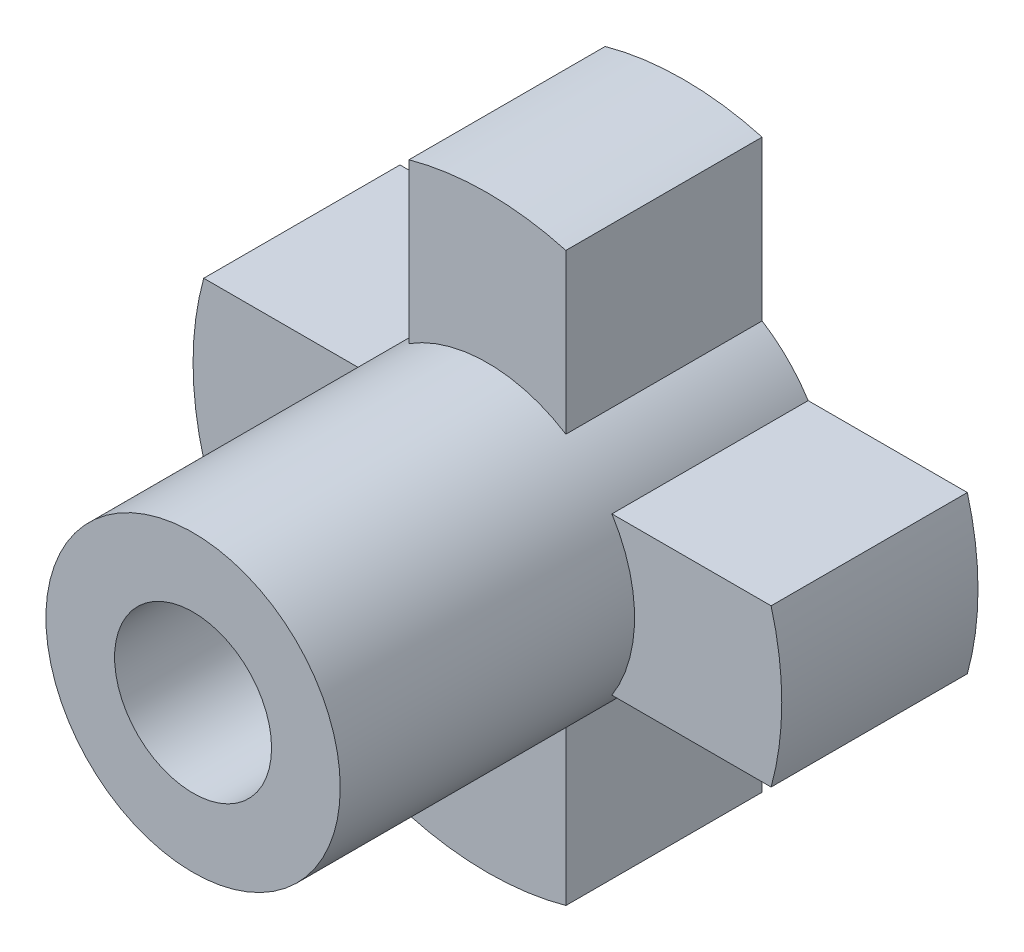
ISO-10303-21;
HEADER;
FILE_DESCRIPTION(('STEP AP214'),'2;1');
FILE_NAME('part.step','',(''),(''),'','','');
FILE_SCHEMA(('AUTOMOTIVE_DESIGN { 1 0 10303 214 1 1 1 1 }'));
ENDSEC;
DATA;
#1=APPLICATION_CONTEXT('core data for automotive mechanical design processes');
#2=APPLICATION_PROTOCOL_DEFINITION('international standard','automotive_design',2000,#1);
#3=PRODUCT_CONTEXT('',#1,'mechanical');
#4=PRODUCT('Part','Part','',(#3));
#5=PRODUCT_RELATED_PRODUCT_CATEGORY('part','',(#4));
#6=PRODUCT_DEFINITION_FORMATION('','',#4);
#7=PRODUCT_DEFINITION_CONTEXT('part definition',#1,'design');
#8=PRODUCT_DEFINITION('design','',#6,#7);
#9=PRODUCT_DEFINITION_SHAPE('','',#8);
#10=(LENGTH_UNIT() NAMED_UNIT(*) SI_UNIT(.MILLI.,.METRE.));
#11=(NAMED_UNIT(*) PLANE_ANGLE_UNIT() SI_UNIT($,.RADIAN.));
#12=(NAMED_UNIT(*) SI_UNIT($,.STERADIAN.) SOLID_ANGLE_UNIT());
#13=UNCERTAINTY_MEASURE_WITH_UNIT(LENGTH_MEASURE(1.E-05),#10,'distance_accuracy_value','');
#14=(GEOMETRIC_REPRESENTATION_CONTEXT(3) GLOBAL_UNCERTAINTY_ASSIGNED_CONTEXT((#13)) GLOBAL_UNIT_ASSIGNED_CONTEXT((#10,
#11,#12)) REPRESENTATION_CONTEXT('',''));
#15=CARTESIAN_POINT('',(0.,0.,0.));
#16=DIRECTION('',(0.,0.,1.));
#17=DIRECTION('',(1.,0.,0.));
#18=AXIS2_PLACEMENT_3D('',#15,#16,#17);
#19=CARTESIAN_POINT('',(0.,0.,10.));
#20=DIRECTION('',(0.,0.,-1.));
#21=DIRECTION('',(-1.,0.,0.));
#22=AXIS2_PLACEMENT_3D('',#19,#20,#21);
#23=CYLINDRICAL_SURFACE('',#22,15.);
#24=CARTESIAN_POINT('',(0.,0.,10.));
#25=DIRECTION('',(0.,0.,1.));
#26=DIRECTION('',(1.,0.,0.));
#27=AXIS2_PLACEMENT_3D('',#24,#25,#26);
#28=CIRCLE('',#27,15.);
#29=CARTESIAN_POINT('',(-4.,-14.456832294801,10.));
#30=VERTEX_POINT('',#29);
#31=CARTESIAN_POINT('',(4.,-14.456832294801,10.));
#32=VERTEX_POINT('',#31);
#33=EDGE_CURVE('E269',#30,#32,#28,.T.);
#34=ORIENTED_EDGE('',*,*,#33,.F.);
#35=DIRECTION('',(0.,0.,-1.));
#36=VECTOR('',#35,1.);
#37=CARTESIAN_POINT('',(-4.,-14.456832294801,20.));
#38=LINE('',#37,#36);
#39=CARTESIAN_POINT('',(-4.,-14.456832294801,0.));
#40=VERTEX_POINT('',#39);
#41=EDGE_CURVE('E196',#30,#40,#38,.T.);
#42=ORIENTED_EDGE('',*,*,#41,.T.);
#43=CARTESIAN_POINT('',(0.,0.,0.));
#44=DIRECTION('',(0.,0.,1.));
#45=DIRECTION('',(1.,0.,0.));
#46=AXIS2_PLACEMENT_3D('',#43,#44,#45);
#47=CIRCLE('',#46,15.);
#48=CARTESIAN_POINT('',(4.,-14.456832294801,0.));
#49=VERTEX_POINT('',#48);
#50=EDGE_CURVE('E271',#40,#49,#47,.T.);
#51=ORIENTED_EDGE('',*,*,#50,.T.);
#52=DIRECTION('',(0.,0.,-1.));
#53=VECTOR('',#52,1.);
#54=CARTESIAN_POINT('',(4.,-14.456832294801,20.));
#55=LINE('',#54,#53);
#56=EDGE_CURVE('E234',#32,#49,#55,.T.);
#57=ORIENTED_EDGE('',*,*,#56,.F.);
#58=EDGE_LOOP('',(#34,#42,#51,#57));
#59=FACE_BOUND('',#58,.T.);
#60=ADVANCED_FACE('F33',(#59),#23,.T.);
#61=CARTESIAN_POINT('',(-14.456832294801,4.,0.));
#62=VERTEX_POINT('',#61);
#63=CARTESIAN_POINT('',(-14.456832294801,-4.,0.));
#64=VERTEX_POINT('',#63);
#65=EDGE_CURVE('E274',#62,#64,#47,.T.);
#66=ORIENTED_EDGE('',*,*,#65,.T.);
#67=DIRECTION('',(0.,0.,-1.));
#68=VECTOR('',#67,1.);
#69=CARTESIAN_POINT('',(-14.456832294801,-4.,20.));
#70=LINE('',#69,#68);
#71=CARTESIAN_POINT('',(-14.456832294801,-4.,10.));
#72=VERTEX_POINT('',#71);
#73=EDGE_CURVE('E64',#72,#64,#70,.T.);
#74=ORIENTED_EDGE('',*,*,#73,.F.);
#75=CARTESIAN_POINT('',(-14.456832294801,4.,10.));
#76=VERTEX_POINT('',#75);
#77=EDGE_CURVE('E294',#76,#72,#28,.T.);
#78=ORIENTED_EDGE('',*,*,#77,.F.);
#79=DIRECTION('',(0.,0.,-1.));
#80=VECTOR('',#79,1.);
#81=CARTESIAN_POINT('',(-14.456832294801,4.,20.));
#82=LINE('',#81,#80);
#83=EDGE_CURVE('E177',#76,#62,#82,.T.);
#84=ORIENTED_EDGE('',*,*,#83,.T.);
#85=EDGE_LOOP('',(#66,#74,#78,#84));
#86=FACE_BOUND('',#85,.T.);
#87=ADVANCED_FACE('F281',(#86),#23,.T.);
#88=CARTESIAN_POINT('',(4.,14.456832294801,0.));
#89=VERTEX_POINT('',#88);
#90=CARTESIAN_POINT('',(-4.,14.456832294801,0.));
#91=VERTEX_POINT('',#90);
#92=EDGE_CURVE('E270',#89,#91,#47,.T.);
#93=ORIENTED_EDGE('',*,*,#92,.T.);
#94=DIRECTION('',(0.,0.,-1.));
#95=VECTOR('',#94,1.);
#96=CARTESIAN_POINT('',(-4.,14.456832294801,20.));
#97=LINE('',#96,#95);
#98=CARTESIAN_POINT('',(-4.,14.456832294801,10.));
#99=VERTEX_POINT('',#98);
#100=EDGE_CURVE('E201',#99,#91,#97,.T.);
#101=ORIENTED_EDGE('',*,*,#100,.F.);
#102=CARTESIAN_POINT('',(4.,14.456832294801,10.));
#103=VERTEX_POINT('',#102);
#104=EDGE_CURVE('E266',#103,#99,#28,.T.);
#105=ORIENTED_EDGE('',*,*,#104,.F.);
#106=DIRECTION('',(0.,0.,-1.));
#107=VECTOR('',#106,1.);
#108=CARTESIAN_POINT('',(4.,14.456832294801,20.));
#109=LINE('',#108,#107);
#110=EDGE_CURVE('E187',#103,#89,#109,.T.);
#111=ORIENTED_EDGE('',*,*,#110,.T.);
#112=EDGE_LOOP('',(#93,#101,#105,#111));
#113=FACE_BOUND('',#112,.T.);
#114=ADVANCED_FACE('F324',(#113),#23,.T.);
#115=CARTESIAN_POINT('',(0.,0.,10.));
#116=DIRECTION('',(0.,0.,1.));
#117=DIRECTION('',(1.,0.,0.));
#118=AXIS2_PLACEMENT_3D('',#115,#116,#117);
#119=PLANE('',#118);
#120=DIRECTION('',(0.,1.,0.));
#121=VECTOR('',#120,1.);
#122=CARTESIAN_POINT('',(-3.99999999999999,0.,10.));
#123=LINE('',#122,#121);
#124=CARTESIAN_POINT('',(-4.,-6.34428877022476,10.));
#125=VERTEX_POINT('',#124);
#126=EDGE_CURVE('E253',#30,#125,#123,.T.);
#127=ORIENTED_EDGE('',*,*,#126,.F.);
#128=ORIENTED_EDGE('',*,*,#33,.T.);
#129=DIRECTION('',(0.,-1.,0.));
#130=VECTOR('',#129,1.);
#131=CARTESIAN_POINT('',(4.,0.,10.));
#132=LINE('',#131,#130);
#133=CARTESIAN_POINT('',(4.,-6.34428877022476,10.));
#134=VERTEX_POINT('',#133);
#135=EDGE_CURVE('E241',#134,#32,#132,.T.);
#136=ORIENTED_EDGE('',*,*,#135,.F.);
#137=CARTESIAN_POINT('',(0.,0.,10.));
#138=DIRECTION('',(0.,0.,1.));
#139=DIRECTION('',(1.,0.,0.));
#140=AXIS2_PLACEMENT_3D('',#137,#138,#139);
#141=CIRCLE('',#140,7.5);
#142=EDGE_CURVE('E265',#125,#134,#141,.T.);
#143=ORIENTED_EDGE('',*,*,#142,.F.);
#144=EDGE_LOOP('',(#127,#128,#136,#143));
#145=FACE_BOUND('',#144,.T.);
#146=ADVANCED_FACE('F302',(#145),#119,.T.);
#147=DIRECTION('',(-1.,0.,0.));
#148=VECTOR('',#147,1.);
#149=CARTESIAN_POINT('',(0.,-4.,10.));
#150=LINE('',#149,#148);
#151=CARTESIAN_POINT('',(-6.34428877022476,-4.,10.));
#152=VERTEX_POINT('',#151);
#153=EDGE_CURVE('E251',#152,#72,#150,.T.);
#154=ORIENTED_EDGE('',*,*,#153,.F.);
#155=CARTESIAN_POINT('',(-6.34428877022476,4.,10.));
#156=VERTEX_POINT('',#155);
#157=EDGE_CURVE('E47',#156,#152,#141,.T.);
#158=ORIENTED_EDGE('',*,*,#157,.F.);
#159=DIRECTION('',(1.,0.,0.));
#160=VECTOR('',#159,1.);
#161=CARTESIAN_POINT('',(0.,4.,10.));
#162=LINE('',#161,#160);
#163=EDGE_CURVE('E249',#76,#156,#162,.T.);
#164=ORIENTED_EDGE('',*,*,#163,.F.);
#165=ORIENTED_EDGE('',*,*,#77,.T.);
#166=EDGE_LOOP('',(#154,#158,#164,#165));
#167=FACE_BOUND('',#166,.T.);
#168=ADVANCED_FACE('F292',(#167),#119,.T.);
#169=DIRECTION('',(0.,1.,0.));
#170=VECTOR('',#169,1.);
#171=CARTESIAN_POINT('',(-4.,0.,10.));
#172=LINE('',#171,#170);
#173=CARTESIAN_POINT('',(-4.,6.34428877022476,10.));
#174=VERTEX_POINT('',#173);
#175=EDGE_CURVE('E247',#174,#99,#172,.T.);
#176=ORIENTED_EDGE('',*,*,#175,.F.);
#177=CARTESIAN_POINT('',(4.,6.34428877022476,10.));
#178=VERTEX_POINT('',#177);
#179=EDGE_CURVE('E11',#178,#174,#141,.T.);
#180=ORIENTED_EDGE('',*,*,#179,.F.);
#181=DIRECTION('',(0.,-1.,0.));
#182=VECTOR('',#181,1.);
#183=CARTESIAN_POINT('',(4.,0.,10.));
#184=LINE('',#183,#182);
#185=EDGE_CURVE('E245',#103,#178,#184,.T.);
#186=ORIENTED_EDGE('',*,*,#185,.F.);
#187=ORIENTED_EDGE('',*,*,#104,.T.);
#188=EDGE_LOOP('',(#176,#180,#186,#187));
#189=FACE_BOUND('',#188,.T.);
#190=ADVANCED_FACE('F319',(#189),#119,.T.);
#191=CARTESIAN_POINT('',(14.456832294801,-4.,0.));
#192=VERTEX_POINT('',#191);
#193=CARTESIAN_POINT('',(14.456832294801,4.,0.));
#194=VERTEX_POINT('',#193);
#195=EDGE_CURVE('E263',#192,#194,#47,.T.);
#196=ORIENTED_EDGE('',*,*,#195,.T.);
#197=DIRECTION('',(0.,0.,-1.));
#198=VECTOR('',#197,1.);
#199=CARTESIAN_POINT('',(14.456832294801,4.,20.));
#200=LINE('',#199,#198);
#201=CARTESIAN_POINT('',(14.456832294801,4.,10.));
#202=VERTEX_POINT('',#201);
#203=EDGE_CURVE('E168',#202,#194,#200,.T.);
#204=ORIENTED_EDGE('',*,*,#203,.F.);
#205=CARTESIAN_POINT('',(14.456832294801,-4.,10.));
#206=VERTEX_POINT('',#205);
#207=EDGE_CURVE('E267',#206,#202,#28,.T.);
#208=ORIENTED_EDGE('',*,*,#207,.F.);
#209=DIRECTION('',(0.,0.,-1.));
#210=VECTOR('',#209,1.);
#211=CARTESIAN_POINT('',(14.456832294801,-4.,20.));
#212=LINE('',#211,#210);
#213=EDGE_CURVE('E236',#206,#192,#212,.T.);
#214=ORIENTED_EDGE('',*,*,#213,.T.);
#215=EDGE_LOOP('',(#196,#204,#208,#214));
#216=FACE_BOUND('',#215,.T.);
#217=ADVANCED_FACE('F35',(#216),#23,.T.);
#218=DIRECTION('',(1.,0.,0.));
#219=VECTOR('',#218,1.);
#220=CARTESIAN_POINT('',(0.,4.,10.));
#221=LINE('',#220,#219);
#222=CARTESIAN_POINT('',(6.34428877022476,4.,10.));
#223=VERTEX_POINT('',#222);
#224=EDGE_CURVE('E243',#223,#202,#221,.T.);
#225=ORIENTED_EDGE('',*,*,#224,.F.);
#226=CARTESIAN_POINT('',(6.34428877022476,-4.,10.));
#227=VERTEX_POINT('',#226);
#228=EDGE_CURVE('E49',#227,#223,#141,.T.);
#229=ORIENTED_EDGE('',*,*,#228,.F.);
#230=DIRECTION('',(-1.,0.,0.));
#231=VECTOR('',#230,1.);
#232=CARTESIAN_POINT('',(0.,-4.,10.));
#233=LINE('',#232,#231);
#234=EDGE_CURVE('E233',#206,#227,#233,.T.);
#235=ORIENTED_EDGE('',*,*,#234,.F.);
#236=ORIENTED_EDGE('',*,*,#207,.T.);
#237=EDGE_LOOP('',(#225,#229,#235,#236));
#238=FACE_BOUND('',#237,.T.);
#239=ADVANCED_FACE('F316',(#238),#119,.T.);
#240=CARTESIAN_POINT('',(0.,0.,0.));
#241=DIRECTION('',(0.,0.,1.));
#242=DIRECTION('',(1.,0.,0.));
#243=AXIS2_PLACEMENT_3D('',#240,#241,#242);
#244=PLANE('',#243);
#245=ORIENTED_EDGE('',*,*,#50,.F.);
#246=DIRECTION('',(0.,-1.,0.));
#247=VECTOR('',#246,1.);
#248=CARTESIAN_POINT('',(-4.,-14.456832294801,0.));
#249=LINE('',#248,#247);
#250=CARTESIAN_POINT('',(-4.,-6.34428877022476,0.));
#251=VERTEX_POINT('',#250);
#252=EDGE_CURVE('E215',#251,#40,#249,.T.);
#253=ORIENTED_EDGE('',*,*,#252,.F.);
#254=CARTESIAN_POINT('',(0.,0.,0.));
#255=DIRECTION('',(0.,0.,1.));
#256=DIRECTION('',(-1.,0.,0.));
#257=AXIS2_PLACEMENT_3D('',#254,#255,#256);
#258=CIRCLE('',#257,7.5);
#259=CARTESIAN_POINT('',(-6.34428877022476,-4.,0.));
#260=VERTEX_POINT('',#259);
#261=EDGE_CURVE('E211',#260,#251,#258,.T.);
#262=ORIENTED_EDGE('',*,*,#261,.F.);
#263=DIRECTION('',(1.,0.,0.));
#264=VECTOR('',#263,1.);
#265=CARTESIAN_POINT('',(-14.456832294801,-4.,0.));
#266=LINE('',#265,#264);
#267=EDGE_CURVE('E209',#64,#260,#266,.T.);
#268=ORIENTED_EDGE('',*,*,#267,.F.);
#269=ORIENTED_EDGE('',*,*,#65,.F.);
#270=DIRECTION('',(-1.,0.,0.));
#271=VECTOR('',#270,1.);
#272=CARTESIAN_POINT('',(-14.456832294801,4.,0.));
#273=LINE('',#272,#271);
#274=CARTESIAN_POINT('',(-6.34428877022476,4.,0.));
#275=VERTEX_POINT('',#274);
#276=EDGE_CURVE('E199',#275,#62,#273,.T.);
#277=ORIENTED_EDGE('',*,*,#276,.F.);
#278=CARTESIAN_POINT('',(0.,0.,0.));
#279=DIRECTION('',(0.,0.,1.));
#280=DIRECTION('',(-1.,0.,0.));
#281=AXIS2_PLACEMENT_3D('',#278,#279,#280);
#282=CIRCLE('',#281,7.5);
#283=CARTESIAN_POINT('',(-4.,6.34428877022476,0.));
#284=VERTEX_POINT('',#283);
#285=EDGE_CURVE('E195',#284,#275,#282,.T.);
#286=ORIENTED_EDGE('',*,*,#285,.F.);
#287=DIRECTION('',(0.,-1.,0.));
#288=VECTOR('',#287,1.);
#289=CARTESIAN_POINT('',(-4.,6.34428877022476,0.));
#290=LINE('',#289,#288);
#291=EDGE_CURVE('E192',#91,#284,#290,.T.);
#292=ORIENTED_EDGE('',*,*,#291,.F.);
#293=ORIENTED_EDGE('',*,*,#92,.F.);
#294=DIRECTION('',(0.,1.,0.));
#295=VECTOR('',#294,1.);
#296=CARTESIAN_POINT('',(4.,6.34428877022476,0.));
#297=LINE('',#296,#295);
#298=CARTESIAN_POINT('',(4.,6.34428877022476,0.));
#299=VERTEX_POINT('',#298);
#300=EDGE_CURVE('E182',#299,#89,#297,.T.);
#301=ORIENTED_EDGE('',*,*,#300,.F.);
#302=CARTESIAN_POINT('',(0.,0.,0.));
#303=DIRECTION('',(0.,0.,1.));
#304=DIRECTION('',(-1.,0.,0.));
#305=AXIS2_PLACEMENT_3D('',#302,#303,#304);
#306=CIRCLE('',#305,7.5);
#307=CARTESIAN_POINT('',(6.34428877022476,4.,0.));
#308=VERTEX_POINT('',#307);
#309=EDGE_CURVE('E162',#308,#299,#306,.T.);
#310=ORIENTED_EDGE('',*,*,#309,.F.);
#311=DIRECTION('',(-1.,0.,0.));
#312=VECTOR('',#311,1.);
#313=CARTESIAN_POINT('',(6.34428877022476,4.,0.));
#314=LINE('',#313,#312);
#315=EDGE_CURVE('E171',#194,#308,#314,.T.);
#316=ORIENTED_EDGE('',*,*,#315,.F.);
#317=ORIENTED_EDGE('',*,*,#195,.F.);
#318=DIRECTION('',(1.,0.,0.));
#319=VECTOR('',#318,1.);
#320=CARTESIAN_POINT('',(6.34428877022476,-4.,0.));
#321=LINE('',#320,#319);
#322=CARTESIAN_POINT('',(6.34428877022476,-4.,0.));
#323=VERTEX_POINT('',#322);
#324=EDGE_CURVE('E225',#323,#192,#321,.T.);
#325=ORIENTED_EDGE('',*,*,#324,.F.);
#326=CARTESIAN_POINT('',(0.,0.,0.));
#327=DIRECTION('',(0.,0.,1.));
#328=DIRECTION('',(-1.,0.,0.));
#329=AXIS2_PLACEMENT_3D('',#326,#327,#328);
#330=CIRCLE('',#329,7.5);
#331=CARTESIAN_POINT('',(4.,-6.34428877022476,0.));
#332=VERTEX_POINT('',#331);
#333=EDGE_CURVE('E56',#332,#323,#330,.T.);
#334=ORIENTED_EDGE('',*,*,#333,.F.);
#335=DIRECTION('',(0.,1.,0.));
#336=VECTOR('',#335,1.);
#337=CARTESIAN_POINT('',(4.,-14.456832294801,0.));
#338=LINE('',#337,#336);
#339=EDGE_CURVE('E227',#49,#332,#338,.T.);
#340=ORIENTED_EDGE('',*,*,#339,.F.);
#341=EDGE_LOOP('',(#245,#253,#262,#268,#269,#277,#286,#292,#293,#301,#310,#316,#317,#325,#334,#340));
#342=FACE_BOUND('',#341,.T.);
#343=ADVANCED_FACE('F180',(#342),#244,.F.);
#344=CARTESIAN_POINT('',(0.,0.,25.));
#345=DIRECTION('',(0.,0.,-1.));
#346=DIRECTION('',(-1.,0.,0.));
#347=AXIS2_PLACEMENT_3D('',#344,#345,#346);
#348=CYLINDRICAL_SURFACE('',#347,7.5);
#349=CARTESIAN_POINT('',(-7.5,0.,14.5040404307137));
#350=CARTESIAN_POINT('',(-7.49999846371307,-0.0833653601889498,14.5040373639661));
#351=CARTESIAN_POINT('',(-7.49859577767346,-0.166769490302284,14.4970671662622));
#352=CARTESIAN_POINT('',(-7.49313548434847,-0.331220261533529,14.4693926805408));
#353=CARTESIAN_POINT('',(-7.48907576790279,-0.412264976312034,14.4486774815114));
#354=CARTESIAN_POINT('',(-7.4787547391743,-0.56959545789497,14.3941785202825));
#355=CARTESIAN_POINT('',(-7.47249553615077,-0.645885701899702,14.3604072754466));
#356=CARTESIAN_POINT('',(-7.45845597052971,-0.791711983296339,14.2807920594467));
#357=CARTESIAN_POINT('',(-7.4506756985356,-0.861248422613718,14.2349488073029));
#358=CARTESIAN_POINT('',(-7.43433247994955,-0.992540215972298,14.1318326892765));
#359=CARTESIAN_POINT('',(-7.42576118256521,-1.05419092673779,14.0744278976269));
#360=CARTESIAN_POINT('',(-7.40886270678882,-1.16705513491204,13.9501018061261));
#361=CARTESIAN_POINT('',(-7.40053554750636,-1.21826781715564,13.883179763711));
#362=CARTESIAN_POINT('',(-7.38498662718923,-1.30924763002143,13.7409661411958));
#363=CARTESIAN_POINT('',(-7.37777561047419,-1.3489064082988,13.6656039650191));
#364=CARTESIAN_POINT('',(-7.36539402087627,-1.41495849987046,13.5091177022075));
#365=CARTESIAN_POINT('',(-7.36022324642942,-1.44135312365586,13.4279941856941));
#366=CARTESIAN_POINT('',(-7.35259207878307,-1.47978794982724,13.2634138848518));
#367=CARTESIAN_POINT('',(-7.35009705160781,-1.49201174693817,13.1800016145003));
#368=CARTESIAN_POINT('',(-7.34799562590941,-1.50232819158918,13.0122756986671));
#369=CARTESIAN_POINT('',(-7.34838893201761,-1.50042228407025,12.9279621462334));
#370=CARTESIAN_POINT('',(-7.35198826722277,-1.48268185965273,12.7621702486822));
#371=CARTESIAN_POINT('',(-7.35515179288145,-1.46705781036586,12.6806683222727));
#372=CARTESIAN_POINT('',(-7.36386819240002,-1.42265682693458,12.5214663157192));
#373=CARTESIAN_POINT('',(-7.36942118036668,-1.39387926465102,12.4437664173351));
#374=CARTESIAN_POINT('',(-7.38233427750612,-1.32378717551208,12.2937675381583));
#375=CARTESIAN_POINT('',(-7.38970634720557,-1.28238922684817,12.2215086113599));
#376=CARTESIAN_POINT('',(-7.40541928159593,-1.18829036185902,12.0848841557544));
#377=CARTESIAN_POINT('',(-7.41376025757549,-1.13558814653524,12.0205195354369));
#378=CARTESIAN_POINT('',(-7.43065531862193,-1.01924990184088,11.9002963270283));
#379=CARTESIAN_POINT('',(-7.43921053816357,-0.955434241818667,11.844611578925));
#380=CARTESIAN_POINT('',(-7.45543273071613,-0.819277536093015,11.7447096612618));
#381=CARTESIAN_POINT('',(-7.4630996923346,-0.746936381069084,11.7004926387733));
#382=CARTESIAN_POINT('',(-7.47670035241331,-0.595589080318381,11.6247491668747));
#383=CARTESIAN_POINT('',(-7.48263133272408,-0.51657272937795,11.5932425902469));
#384=CARTESIAN_POINT('',(-7.49207113481787,-0.354223464672997,11.5439997196558));
#385=CARTESIAN_POINT('',(-7.49558025000797,-0.270891075108674,11.5262617576032));
#386=CARTESIAN_POINT('',(-7.49974007800302,-0.103769108440725,11.5053057500222));
#387=CARTESIAN_POINT('',(-7.50043761978705,-0.020010492488364,11.5018498014033));
#388=CARTESIAN_POINT('',(-7.49902577895154,0.146887401289071,11.5089152191269));
#389=CARTESIAN_POINT('',(-7.49691655412169,0.23002671366569,11.5194357997426));
#390=CARTESIAN_POINT('',(-7.49015748012026,0.392558489919812,11.5539579910296));
#391=CARTESIAN_POINT('',(-7.4855306460631,0.471977922509856,11.5778375334605));
#392=CARTESIAN_POINT('',(-7.47425328091549,0.625685441249502,11.6382664046974));
#393=CARTESIAN_POINT('',(-7.4676025982134,0.69997314245631,11.6748166827289));
#394=CARTESIAN_POINT('',(-7.45289867299942,0.842311760529327,11.7600641666906));
#395=CARTESIAN_POINT('',(-7.44482925655578,0.910275190128282,11.8089046022721));
#396=CARTESIAN_POINT('',(-7.42822102244824,1.03712702867881,11.9171542175246));
#397=CARTESIAN_POINT('',(-7.41968215452582,1.09601446339614,11.9765645303135));
#398=CARTESIAN_POINT('',(-7.40293955335447,1.20396088616126,12.1053504585503));
#399=CARTESIAN_POINT('',(-7.39474290349956,1.25285655367298,12.1748640470457));
#400=CARTESIAN_POINT('',(-7.37976287694291,1.33827813007681,12.3212574727487));
#401=CARTESIAN_POINT('',(-7.37297944370014,1.37480453388435,12.398137015074));
#402=CARTESIAN_POINT('',(-7.36165110876574,1.43422776237294,12.556692799938));
#403=CARTESIAN_POINT('',(-7.3570946230828,1.45719524968658,12.6383416925291));
#404=CARTESIAN_POINT('',(-7.35071155188038,1.48906297744079,12.80444061095));
#405=CARTESIAN_POINT('',(-7.34888461036667,1.49796505233767,12.8888902700277));
#406=CARTESIAN_POINT('',(-7.34818724447069,1.5013813663012,13.0565537275301));
#407=CARTESIAN_POINT('',(-7.34926378783951,1.49615368210634,13.1397621541042));
#408=CARTESIAN_POINT('',(-7.35413360226921,1.47202845615009,13.3040879055712));
#409=CARTESIAN_POINT('',(-7.35792685150754,1.45313102419395,13.3852052472559));
#410=CARTESIAN_POINT('',(-7.36777896328738,1.40231785274843,13.5428819975745));
#411=CARTESIAN_POINT('',(-7.37383231528246,1.37043376007602,13.6194519714673));
#412=CARTESIAN_POINT('',(-7.38752572461255,1.29458196690241,13.7661960118153));
#413=CARTESIAN_POINT('',(-7.39516591498341,1.25061325316232,13.8363695413014));
#414=CARTESIAN_POINT('',(-7.41133440784838,1.15095887217962,13.9696137889391));
#415=CARTESIAN_POINT('',(-7.41987559364549,1.09508683085277,14.0325435786151));
#416=CARTESIAN_POINT('',(-7.43679122807932,0.97359655351971,14.1482197390074));
#417=CARTESIAN_POINT('',(-7.44516563794777,0.907976080730002,14.2009637661896));
#418=CARTESIAN_POINT('',(-7.46090748581957,0.76802644363237,14.2952923966333));
#419=CARTESIAN_POINT('',(-7.46826346828869,0.693613326644753,14.3367544356337));
#420=CARTESIAN_POINT('',(-7.481026876275,0.5387495414111,14.4065196146085));
#421=CARTESIAN_POINT('',(-7.48643605707924,0.45830439129469,14.4348346150124));
#422=CARTESIAN_POINT('',(-7.49364558893056,0.314732233385669,14.4720183527807));
#423=CARTESIAN_POINT('',(-7.49601454737677,0.252422496020677,14.4840052212753));
#424=CARTESIAN_POINT('',(-7.49919231209839,0.1267492878151,14.5000172992512));
#425=CARTESIAN_POINT('',(-7.50000116809732,0.0633858506229285,14.5040427624783));
#426=CARTESIAN_POINT('',(-7.5,0.,14.5040404307137));
#427=B_SPLINE_CURVE_WITH_KNOTS('',3,(#349,#350,#351,#352,#353,#354,#355,#356,#357,#358,#359,
#360,#361,#362,#363,#364,#365,#366,#367,#368,#369,#370,#371,#372,#373,#374,#375,#376,#377,#378,
#379,#380,#381,#382,#383,#384,#385,#386,#387,#388,#389,#390,#391,#392,#393,#394,#395,#396,#397,
#398,#399,#400,#401,#402,#403,#404,#405,#406,#407,#408,#409,#410,#411,#412,#413,#414,#415,#416,
#417,#418,#419,#420,#421,#422,#423,#424,#425,#426),.UNSPECIFIED.,.T.,.F.,(4,2,2,2,2,2,2,2,2,2,2,
2,2,2,2,2,2,2,2,2,2,2,2,2,2,2,2,2,2,2,2,2,2,2,2,2,2,2,4),(0.,0.249864195991888,
0.499926976036985,0.749750602875513,0.999559353346296,1.25239900516828,1.50525839512105,
1.76041792508884,2.01555224047796,2.26734277655381,2.51910756421838,2.76707590509418,
3.01505608880595,3.26471235305389,3.51439732124506,3.76857378737026,4.0227535130973,
4.27732912281036,4.53187388547054,4.78216103514398,5.03243411486801,5.28045680926085,
5.52849808824034,5.77957599050038,6.03068082518895,6.28560942868839,6.540527830852,
6.79410571549085,7.04765052495622,7.29659583851552,7.54553915238913,7.79387941879665,
8.042240513728,8.29482114358715,8.54745981799396,8.80274245013456,9.05779433276278,
9.24778162934841,9.43776287056494),.UNSPECIFIED.);
#428=CARTESIAN_POINT('',(-7.5,0.,14.5040404307137));
#429=VERTEX_POINT('',#428);
#430=EDGE_CURVE('E212',#429,#429,#427,.T.);
#431=ORIENTED_EDGE('',*,*,#430,.T.);
#432=EDGE_LOOP('',(#431));
#433=FACE_BOUND('',#432,.T.);
#434=ORIENTED_EDGE('',*,*,#157,.T.);
#435=DIRECTION('',(0.,0.,-1.));
#436=VECTOR('',#435,1.);
#437=CARTESIAN_POINT('',(-6.34428877022476,-4.,20.));
#438=LINE('',#437,#436);
#439=EDGE_CURVE('E221',#152,#260,#438,.T.);
#440=ORIENTED_EDGE('',*,*,#439,.T.);
#441=ORIENTED_EDGE('',*,*,#261,.T.);
#442=DIRECTION('',(0.,0.,-1.));
#443=VECTOR('',#442,1.);
#444=CARTESIAN_POINT('',(-4.,-6.34428877022476,20.));
#445=LINE('',#444,#443);
#446=EDGE_CURVE('E219',#125,#251,#445,.T.);
#447=ORIENTED_EDGE('',*,*,#446,.F.);
#448=ORIENTED_EDGE('',*,*,#142,.T.);
#449=DIRECTION('',(0.,0.,-1.));
#450=VECTOR('',#449,1.);
#451=CARTESIAN_POINT('',(4.,-6.34428877022476,20.));
#452=LINE('',#451,#450);
#453=EDGE_CURVE('E231',#134,#332,#452,.T.);
#454=ORIENTED_EDGE('',*,*,#453,.T.);
#455=ORIENTED_EDGE('',*,*,#333,.T.);
#456=DIRECTION('',(0.,0.,-1.));
#457=VECTOR('',#456,1.);
#458=CARTESIAN_POINT('',(6.34428877022476,-4.,20.));
#459=LINE('',#458,#457);
#460=EDGE_CURVE('E230',#227,#323,#459,.T.);
#461=ORIENTED_EDGE('',*,*,#460,.F.);
#462=ORIENTED_EDGE('',*,*,#228,.T.);
#463=DIRECTION('',(0.,0.,-1.));
#464=VECTOR('',#463,1.);
#465=CARTESIAN_POINT('',(6.34428877022476,4.,20.));
#466=LINE('',#465,#464);
#467=EDGE_CURVE('E155',#223,#308,#466,.T.);
#468=ORIENTED_EDGE('',*,*,#467,.T.);
#469=ORIENTED_EDGE('',*,*,#309,.T.);
#470=DIRECTION('',(0.,0.,-1.));
#471=VECTOR('',#470,1.);
#472=CARTESIAN_POINT('',(4.,6.34428877022476,20.));
#473=LINE('',#472,#471);
#474=EDGE_CURVE('E167',#178,#299,#473,.T.);
#475=ORIENTED_EDGE('',*,*,#474,.F.);
#476=ORIENTED_EDGE('',*,*,#179,.T.);
#477=DIRECTION('',(0.,0.,-1.));
#478=VECTOR('',#477,1.);
#479=CARTESIAN_POINT('',(-4.,6.34428877022476,20.));
#480=LINE('',#479,#478);
#481=EDGE_CURVE('E206',#174,#284,#480,.T.);
#482=ORIENTED_EDGE('',*,*,#481,.T.);
#483=ORIENTED_EDGE('',*,*,#285,.T.);
#484=DIRECTION('',(0.,0.,-1.));
#485=VECTOR('',#484,1.);
#486=CARTESIAN_POINT('',(-6.34428877022476,4.,20.));
#487=LINE('',#486,#485);
#488=EDGE_CURVE('E204',#156,#275,#487,.T.);
#489=ORIENTED_EDGE('',*,*,#488,.F.);
#490=EDGE_LOOP('',(#434,#440,#441,#447,#448,#454,#455,#461,#462,#468,#469,#475,#476,#482,#483,#489));
#491=FACE_BOUND('',#490,.T.);
#492=CARTESIAN_POINT('',(0.,0.,25.));
#493=DIRECTION('',(0.,0.,1.));
#494=DIRECTION('',(1.,0.,0.));
#495=AXIS2_PLACEMENT_3D('',#492,#493,#494);
#496=CIRCLE('',#495,7.5);
#497=CARTESIAN_POINT('',(7.5,0.,25.));
#498=VERTEX_POINT('',#497);
#499=EDGE_CURVE('E259',#498,#498,#496,.T.);
#500=ORIENTED_EDGE('',*,*,#499,.F.);
#501=EDGE_LOOP('',(#500));
#502=FACE_BOUND('',#501,.T.);
#503=ADVANCED_FACE('F158',(#433,#491,#502),#348,.T.);
#504=CARTESIAN_POINT('',(0.,0.,25.));
#505=DIRECTION('',(0.,0.,1.));
#506=DIRECTION('',(1.,0.,0.));
#507=AXIS2_PLACEMENT_3D('',#504,#505,#506);
#508=PLANE('',#507);
#509=CARTESIAN_POINT('',(0.,0.,25.));
#510=DIRECTION('',(0.,0.,1.));
#511=DIRECTION('',(1.,0.,0.));
#512=AXIS2_PLACEMENT_3D('',#509,#510,#511);
#513=CIRCLE('',#512,4.);
#514=CARTESIAN_POINT('',(4.,0.,25.));
#515=VERTEX_POINT('',#514);
#516=EDGE_CURVE('E255',#515,#515,#513,.T.);
#517=ORIENTED_EDGE('',*,*,#516,.F.);
#518=EDGE_LOOP('',(#517));
#519=FACE_BOUND('',#518,.T.);
#520=ORIENTED_EDGE('',*,*,#499,.T.);
#521=EDGE_LOOP('',(#520));
#522=FACE_BOUND('',#521,.T.);
#523=ADVANCED_FACE('F452',(#519,#522),#508,.T.);
#524=CARTESIAN_POINT('',(0.,0.,10.));
#525=DIRECTION('',(0.,0.,1.));
#526=DIRECTION('',(1.,0.,0.));
#527=AXIS2_PLACEMENT_3D('',#524,#525,#526);
#528=CYLINDRICAL_SURFACE('',#527,4.);
#529=CARTESIAN_POINT('',(-4.,0.,11.5040404307137));
#530=CARTESIAN_POINT('',(-4.00000217456151,-0.0812350589378529,11.5040375284105));
#531=CARTESIAN_POINT('',(-3.99750379283184,-0.162450241781792,11.510660190962));
#532=CARTESIAN_POINT('',(-3.98778696006928,-0.322453452352361,11.5368686259836));
#533=CARTESIAN_POINT('',(-3.98056918893993,-0.401241827987616,11.5564525311842));
#534=CARTESIAN_POINT('',(-3.96218832391545,-0.55406078499088,11.6077934324854));
#535=CARTESIAN_POINT('',(-3.9510328434944,-0.628100224162279,11.6395269475354));
#536=CARTESIAN_POINT('',(-3.92588767765353,-0.769799310160255,11.7141468437295));
#537=CARTESIAN_POINT('',(-3.91189723227548,-0.83745723917788,11.7570362162578));
#538=CARTESIAN_POINT('',(-3.88186246971217,-0.967346417045826,11.8546529617846));
#539=CARTESIAN_POINT('',(-3.86576002583566,-1.02927073015119,11.9097706929731));
#540=CARTESIAN_POINT('',(-3.83360220871327,-1.14324421474363,12.0294508653725));
#541=CARTESIAN_POINT('',(-3.81754685135033,-1.19529036359203,12.0940161868015));
#542=CARTESIAN_POINT('',(-3.78662470617731,-1.28998202215985,12.2337578982369));
#543=CARTESIAN_POINT('',(-3.77182648820818,-1.3321939319576,12.3092447972595));
#544=CARTESIAN_POINT('',(-3.74599860237433,-1.40318646334084,12.4668887848822));
#545=CARTESIAN_POINT('',(-3.73496742975881,-1.43197244961239,12.5490431938688));
#546=CARTESIAN_POINT('',(-3.71854412824136,-1.47408431017549,12.7141571709719));
#547=CARTESIAN_POINT('',(-3.71293924350838,-1.48799593218558,12.7969454691491));
#548=CARTESIAN_POINT('',(-3.70738061461215,-1.50179556531648,12.9638565887075));
#549=CARTESIAN_POINT('',(-3.70742453659305,-1.50168936802631,13.0479788445881));
#550=CARTESIAN_POINT('',(-3.71297511632055,-1.48790429610018,13.2098099559266));
#551=CARTESIAN_POINT('',(-3.71815468871122,-1.47503808509003,13.2876013367578));
#552=CARTESIAN_POINT('',(-3.73284938059529,-1.4374416786833,13.439827581119));
#553=CARTESIAN_POINT('',(-3.74236515298863,-1.41270969663258,13.5142619373275));
#554=CARTESIAN_POINT('',(-3.76485702190253,-1.35163748571904,13.6593174984419));
#555=CARTESIAN_POINT('',(-3.77789517988166,-1.31508648737101,13.729839916835));
#556=CARTESIAN_POINT('',(-3.80594210139319,-1.23156073762698,13.8639861683046));
#557=CARTESIAN_POINT('',(-3.82095154457158,-1.18458238728896,13.9276076082334));
#558=CARTESIAN_POINT('',(-3.85248038859113,-1.07781780766549,14.0506440943645));
#559=CARTESIAN_POINT('',(-3.86903347455671,-1.01738298716955,14.1094890714618));
#560=CARTESIAN_POINT('',(-3.90091728164086,-0.88731259081902,14.2163783969195));
#561=CARTESIAN_POINT('',(-3.91624781465952,-0.817675603497363,14.2644210853193));
#562=CARTESIAN_POINT('',(-3.9442639480908,-0.669723436992418,14.3489708277762));
#563=CARTESIAN_POINT('',(-3.95690498259616,-0.591290713844717,14.3852880119347));
#564=CARTESIAN_POINT('',(-3.97778718326962,-0.428836850524581,14.4440230349837));
#565=CARTESIAN_POINT('',(-3.98603030341493,-0.344818210845766,14.4664470472748));
#566=CARTESIAN_POINT('',(-3.99684443228065,-0.178375243148664,14.4956632182556));
#567=CARTESIAN_POINT('',(-3.99969369025686,-0.0961036195622083,14.5032230370962));
#568=CARTESIAN_POINT('',(-4.00025893700126,0.0685724752550252,14.5047314946136));
#569=CARTESIAN_POINT('',(-3.99797606386863,0.150976912983374,14.4986831510304));
#570=CARTESIAN_POINT('',(-3.98871709772643,0.31026204856186,14.473730388405));
#571=CARTESIAN_POINT('',(-3.98192470962305,0.387233328007337,14.4553288869766));
#572=CARTESIAN_POINT('',(-3.96451477091717,0.536941754957222,14.4068543581663));
#573=CARTESIAN_POINT('',(-3.9538967228203,0.609678350347536,14.3767798127656));
#574=CARTESIAN_POINT('',(-3.92949624407681,0.751247765110156,14.3048540182742));
#575=CARTESIAN_POINT('',(-3.91563000209348,0.819903083557796,14.2626827014903));
#576=CARTESIAN_POINT('',(-3.88626671564664,0.949392711726626,14.1681223275421));
#577=CARTESIAN_POINT('',(-3.87076907009516,1.01022412027045,14.1157294981685));
#578=CARTESIAN_POINT('',(-3.8387332949099,1.12603079874454,13.9986363085894));
#579=CARTESIAN_POINT('',(-3.82218696503729,1.18046154123568,13.933398247941));
#580=CARTESIAN_POINT('',(-3.79078815746854,1.27771050031903,13.794389046006));
#581=CARTESIAN_POINT('',(-3.77593583194399,1.32052767414518,13.7206171393252));
#582=CARTESIAN_POINT('',(-3.74966829822463,1.39337773518998,13.5660244439413));
#583=CARTESIAN_POINT('',(-3.73826760328493,1.42335685446918,13.4851756848032));
#584=CARTESIAN_POINT('',(-3.72054032891005,1.46907883466889,13.3190306670258));
#585=CARTESIAN_POINT('',(-3.71421061057491,1.48483050305535,13.2337371945155));
#586=CARTESIAN_POINT('',(-3.70775894792573,1.50086347097839,13.0670242711725));
#587=CARTESIAN_POINT('',(-3.70726444523341,1.50207331495837,12.9857077989968));
#588=CARTESIAN_POINT('',(-3.71158412745292,1.49136715641593,12.8240951144375));
#589=CARTESIAN_POINT('',(-3.71639780898899,1.47945239850124,12.7437988060421));
#590=CARTESIAN_POINT('',(-3.73048141585432,1.44355815630242,12.5889932039971));
#591=CARTESIAN_POINT('',(-3.73961085376663,1.41995798316524,12.5143820844683));
#592=CARTESIAN_POINT('',(-3.76121548297845,1.3616969677992,12.3701349222192));
#593=CARTESIAN_POINT('',(-3.77369151995215,1.32703332944945,12.3005001426435));
#594=CARTESIAN_POINT('',(-3.80139723903965,1.24552075938154,12.164213641016));
#595=CARTESIAN_POINT('',(-3.81673698440964,1.1981283280301,12.0979096339137));
#596=CARTESIAN_POINT('',(-3.84806246757177,1.09334485729906,11.9738988697425));
#597=CARTESIAN_POINT('',(-3.86404840943145,1.03595064012808,11.9161948559269));
#598=CARTESIAN_POINT('',(-3.89590424609881,0.909080396784622,11.8078384748918));
#599=CARTESIAN_POINT('',(-3.91172104900645,0.839118644212991,11.757736677279));
#600=CARTESIAN_POINT('',(-3.94054514457031,0.69121322320082,11.6700177754371));
#601=CARTESIAN_POINT('',(-3.95355221851559,0.61326893409062,11.6324016429773));
#602=CARTESIAN_POINT('',(-3.9757429260668,0.447999082002311,11.5696636016653));
#603=CARTESIAN_POINT('',(-3.98473657158356,0.360413422234207,11.5451533661118));
#604=CARTESIAN_POINT('',(-3.99686242179587,0.181875733606381,11.512347470793));
#605=CARTESIAN_POINT('',(-3.99999756603967,0.0909254163648584,11.5040436792263));
#606=CARTESIAN_POINT('',(-4.,0.,11.5040404307137));
#607=B_SPLINE_CURVE_WITH_KNOTS('',3,(#529,#530,#531,#532,#533,#534,#535,#536,#537,#538,#539,
#540,#541,#542,#543,#544,#545,#546,#547,#548,#549,#550,#551,#552,#553,#554,#555,#556,#557,#558,
#559,#560,#561,#562,#563,#564,#565,#566,#567,#568,#569,#570,#571,#572,#573,#574,#575,#576,#577,
#578,#579,#580,#581,#582,#583,#584,#585,#586,#587,#588,#589,#590,#591,#592,#593,#594,#595,#596,
#597,#598,#599,#600,#601,#602,#603,#604,#605,#606),.UNSPECIFIED.,.T.,.F.,(4,2,2,2,2,2,2,2,2,2,2,
2,2,2,2,2,2,2,2,2,2,2,2,2,2,2,2,2,2,2,2,2,2,2,2,2,2,2,4),(0.,0.24336980156056,0.486704549530461,
0.729571369213575,0.97250337960949,1.22473618582716,1.47704604925622,1.73896674501659,
2.00078269352134,2.25185874416901,2.50283106079707,2.73878345119971,2.97477138060589,
3.21522408387018,3.45575990744259,3.71246153335813,3.96920257905066,4.22991375286075,
4.49050899698846,4.73725019635926,4.98393668390521,5.2211443792384,5.45838293254454,
5.702592218596,5.94689180019868,6.20536519455658,6.46386178920141,6.72343066727204,
6.98283874956507,7.22558763480252,7.46831350211259,7.70363142426534,7.93900886656507,
8.18672471884271,8.43451941997062,8.69572329654039,8.95694749805102,9.22948515032042,
9.50188601796128),.UNSPECIFIED.);
#608=CARTESIAN_POINT('',(-4.,0.,11.5040404307137));
#609=VERTEX_POINT('',#608);
#610=EDGE_CURVE('E37',#609,#609,#607,.T.);
#611=ORIENTED_EDGE('',*,*,#610,.T.);
#612=EDGE_LOOP('',(#611));
#613=FACE_BOUND('',#612,.T.);
#614=CARTESIAN_POINT('',(0.,0.,10.));
#615=DIRECTION('',(0.,0.,1.));
#616=DIRECTION('',(1.,0.,0.));
#617=AXIS2_PLACEMENT_3D('',#614,#615,#616);
#618=CIRCLE('',#617,4.);
#619=CARTESIAN_POINT('',(4.,0.,10.));
#620=VERTEX_POINT('',#619);
#621=EDGE_CURVE('E256',#620,#620,#618,.T.);
#622=ORIENTED_EDGE('',*,*,#621,.F.);
#623=EDGE_LOOP('',(#622));
#624=FACE_BOUND('',#623,.T.);
#625=ORIENTED_EDGE('',*,*,#516,.T.);
#626=EDGE_LOOP('',(#625));
#627=FACE_BOUND('',#626,.T.);
#628=ADVANCED_FACE('F459',(#613,#624,#627),#528,.F.);
#629=CARTESIAN_POINT('',(0.,0.,10.));
#630=DIRECTION('',(0.,0.,1.));
#631=DIRECTION('',(1.,0.,0.));
#632=AXIS2_PLACEMENT_3D('',#629,#630,#631);
#633=PLANE('',#632);
#634=ORIENTED_EDGE('',*,*,#621,.T.);
#635=EDGE_LOOP('',(#634));
#636=FACE_BOUND('',#635,.T.);
#637=ADVANCED_FACE('F376',(#636),#633,.T.);
#638=CARTESIAN_POINT('',(4.,-14.456832294801,20.));
#639=DIRECTION('',(-1.,0.,0.));
#640=DIRECTION('',(0.,-1.,0.));
#641=AXIS2_PLACEMENT_3D('',#638,#639,#640);
#642=PLANE('',#641);
#643=ORIENTED_EDGE('',*,*,#135,.T.);
#644=ORIENTED_EDGE('',*,*,#56,.T.);
#645=ORIENTED_EDGE('',*,*,#339,.T.);
#646=ORIENTED_EDGE('',*,*,#453,.F.);
#647=EDGE_LOOP('',(#643,#644,#645,#646));
#648=FACE_BOUND('',#647,.T.);
#649=ADVANCED_FACE('F307',(#648),#642,.F.);
#650=CARTESIAN_POINT('',(6.34428877022476,-4.,20.));
#651=DIRECTION('',(0.,1.,0.));
#652=DIRECTION('',(-1.,0.,0.));
#653=AXIS2_PLACEMENT_3D('',#650,#651,#652);
#654=PLANE('',#653);
#655=ORIENTED_EDGE('',*,*,#234,.T.);
#656=ORIENTED_EDGE('',*,*,#460,.T.);
#657=ORIENTED_EDGE('',*,*,#324,.T.);
#658=ORIENTED_EDGE('',*,*,#213,.F.);
#659=EDGE_LOOP('',(#655,#656,#657,#658));
#660=FACE_BOUND('',#659,.T.);
#661=ADVANCED_FACE('F312',(#660),#654,.F.);
#662=CARTESIAN_POINT('',(4.,6.34428877022476,20.));
#663=DIRECTION('',(-1.,0.,0.));
#664=DIRECTION('',(0.,-1.,0.));
#665=AXIS2_PLACEMENT_3D('',#662,#663,#664);
#666=PLANE('',#665);
#667=ORIENTED_EDGE('',*,*,#185,.T.);
#668=ORIENTED_EDGE('',*,*,#474,.T.);
#669=ORIENTED_EDGE('',*,*,#300,.T.);
#670=ORIENTED_EDGE('',*,*,#110,.F.);
#671=EDGE_LOOP('',(#667,#668,#669,#670));
#672=FACE_BOUND('',#671,.T.);
#673=ADVANCED_FACE('F387',(#672),#666,.F.);
#674=CARTESIAN_POINT('',(6.34428877022476,4.,20.));
#675=DIRECTION('',(0.,-1.,0.));
#676=DIRECTION('',(1.,0.,0.));
#677=AXIS2_PLACEMENT_3D('',#674,#675,#676);
#678=PLANE('',#677);
#679=ORIENTED_EDGE('',*,*,#224,.T.);
#680=ORIENTED_EDGE('',*,*,#203,.T.);
#681=ORIENTED_EDGE('',*,*,#315,.T.);
#682=ORIENTED_EDGE('',*,*,#467,.F.);
#683=EDGE_LOOP('',(#679,#680,#681,#682));
#684=FACE_BOUND('',#683,.T.);
#685=ADVANCED_FACE('F172',(#684),#678,.F.);
#686=CARTESIAN_POINT('',(-14.456832294801,4.,20.));
#687=DIRECTION('',(0.,-1.,0.));
#688=DIRECTION('',(1.,0.,0.));
#689=AXIS2_PLACEMENT_3D('',#686,#687,#688);
#690=PLANE('',#689);
#691=ORIENTED_EDGE('',*,*,#163,.T.);
#692=ORIENTED_EDGE('',*,*,#488,.T.);
#693=ORIENTED_EDGE('',*,*,#276,.T.);
#694=ORIENTED_EDGE('',*,*,#83,.F.);
#695=EDGE_LOOP('',(#691,#692,#693,#694));
#696=FACE_BOUND('',#695,.T.);
#697=ADVANCED_FACE('F405',(#696),#690,.F.);
#698=CARTESIAN_POINT('',(-4.,6.34428877022476,20.));
#699=DIRECTION('',(1.,0.,0.));
#700=DIRECTION('',(0.,0.,-1.));
#701=AXIS2_PLACEMENT_3D('',#698,#699,#700);
#702=PLANE('',#701);
#703=ORIENTED_EDGE('',*,*,#175,.T.);
#704=ORIENTED_EDGE('',*,*,#100,.T.);
#705=ORIENTED_EDGE('',*,*,#291,.T.);
#706=ORIENTED_EDGE('',*,*,#481,.F.);
#707=EDGE_LOOP('',(#703,#704,#705,#706));
#708=FACE_BOUND('',#707,.T.);
#709=ADVANCED_FACE('F414',(#708),#702,.F.);
#710=CARTESIAN_POINT('',(-4.,-14.456832294801,20.));
#711=DIRECTION('',(1.,0.,0.));
#712=DIRECTION('',(0.,1.,0.));
#713=AXIS2_PLACEMENT_3D('',#710,#711,#712);
#714=PLANE('',#713);
#715=ORIENTED_EDGE('',*,*,#126,.T.);
#716=ORIENTED_EDGE('',*,*,#446,.T.);
#717=ORIENTED_EDGE('',*,*,#252,.T.);
#718=ORIENTED_EDGE('',*,*,#41,.F.);
#719=EDGE_LOOP('',(#715,#716,#717,#718));
#720=FACE_BOUND('',#719,.T.);
#721=ADVANCED_FACE('F424',(#720),#714,.F.);
#722=CARTESIAN_POINT('',(-14.456832294801,-4.,20.));
#723=DIRECTION('',(0.,1.,0.));
#724=DIRECTION('',(-1.,0.,0.));
#725=AXIS2_PLACEMENT_3D('',#722,#723,#724);
#726=PLANE('',#725);
#727=ORIENTED_EDGE('',*,*,#153,.T.);
#728=ORIENTED_EDGE('',*,*,#73,.T.);
#729=ORIENTED_EDGE('',*,*,#267,.T.);
#730=ORIENTED_EDGE('',*,*,#439,.F.);
#731=EDGE_LOOP('',(#727,#728,#729,#730));
#732=FACE_BOUND('',#731,.T.);
#733=ADVANCED_FACE('F288',(#732),#726,.F.);
#734=CARTESIAN_POINT('',(-20.,0.,13.0040404307137));
#735=DIRECTION('',(1.,0.,0.));
#736=DIRECTION('',(0.,0.,-1.));
#737=AXIS2_PLACEMENT_3D('',#734,#735,#736);
#738=CYLINDRICAL_SURFACE('',#737,1.5);
#739=ORIENTED_EDGE('',*,*,#610,.F.);
#740=EDGE_LOOP('',(#739));
#741=FACE_BOUND('',#740,.T.);
#742=ORIENTED_EDGE('',*,*,#430,.F.);
#743=EDGE_LOOP('',(#742));
#744=FACE_BOUND('',#743,.T.);
#745=ADVANCED_FACE('F443',(#741,#744),#738,.F.);
#746=CLOSED_SHELL('',(#60,#87,#114,#146,#168,#190,#217,#239,#343,#503,#523,#628,#637,#649,#661,
#673,#685,#697,#709,#721,#733,#745));
#747=MANIFOLD_SOLID_BREP('B2',#746);
#748=ADVANCED_BREP_SHAPE_REPRESENTATION('',(#18,#747),#14);
#749=SHAPE_DEFINITION_REPRESENTATION(#9,#748);
ENDSEC;
END-ISO-10303-21;
